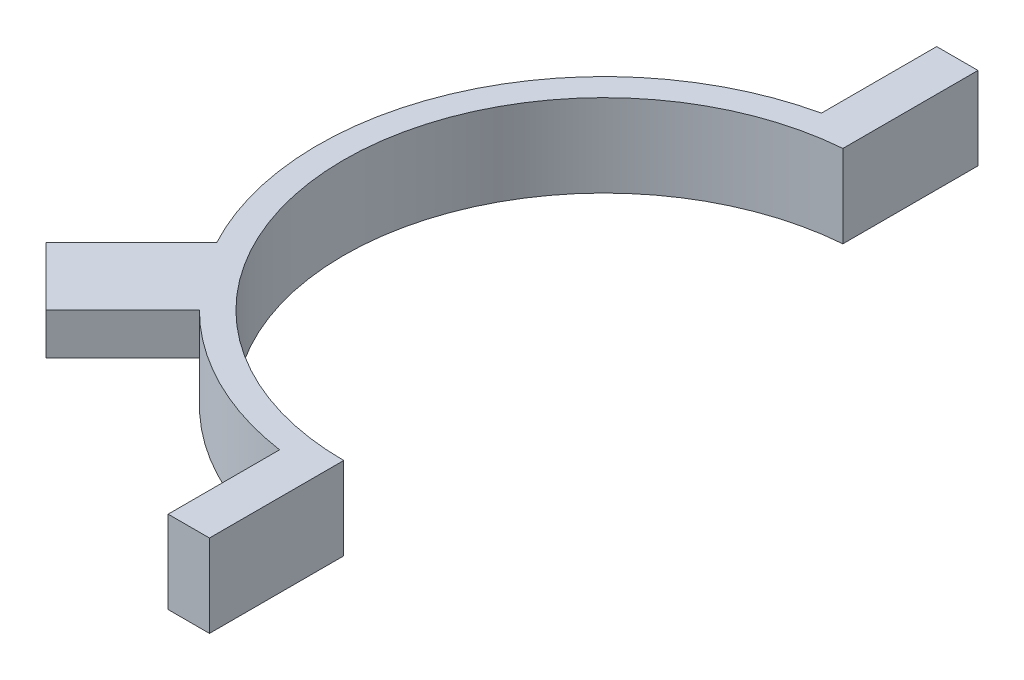
ISO-10303-21;
HEADER;
FILE_DESCRIPTION(('STEP AP214'),'2;1');
FILE_NAME('part.step','',(''),(''),'','','');
FILE_SCHEMA(('AUTOMOTIVE_DESIGN { 1 0 10303 214 1 1 1 1 }'));
ENDSEC;
DATA;
#1=APPLICATION_CONTEXT('core data for automotive mechanical design processes');
#2=APPLICATION_PROTOCOL_DEFINITION('international standard','automotive_design',2000,#1);
#3=PRODUCT_CONTEXT('',#1,'mechanical');
#4=PRODUCT('Part','Part','',(#3));
#5=PRODUCT_RELATED_PRODUCT_CATEGORY('part','',(#4));
#6=PRODUCT_DEFINITION_FORMATION('','',#4);
#7=PRODUCT_DEFINITION_CONTEXT('part definition',#1,'design');
#8=PRODUCT_DEFINITION('design','',#6,#7);
#9=PRODUCT_DEFINITION_SHAPE('','',#8);
#10=(LENGTH_UNIT() NAMED_UNIT(*) SI_UNIT(.MILLI.,.METRE.));
#11=(NAMED_UNIT(*) PLANE_ANGLE_UNIT() SI_UNIT($,.RADIAN.));
#12=(NAMED_UNIT(*) SI_UNIT($,.STERADIAN.) SOLID_ANGLE_UNIT());
#13=UNCERTAINTY_MEASURE_WITH_UNIT(LENGTH_MEASURE(1.E-05),#10,'distance_accuracy_value','');
#14=(GEOMETRIC_REPRESENTATION_CONTEXT(3) GLOBAL_UNCERTAINTY_ASSIGNED_CONTEXT((#13)) GLOBAL_UNIT_ASSIGNED_CONTEXT((#10,
#11,#12)) REPRESENTATION_CONTEXT('',''));
#15=CARTESIAN_POINT('',(0.,0.,0.));
#16=DIRECTION('',(0.,0.,1.));
#17=DIRECTION('',(1.,0.,0.));
#18=AXIS2_PLACEMENT_3D('',#15,#16,#17);
#19=CARTESIAN_POINT('',(0.,10.16,0.));
#20=DIRECTION('',(0.,-1.,0.));
#21=DIRECTION('',(0.,0.,-1.));
#22=AXIS2_PLACEMENT_3D('',#19,#20,#21);
#23=CYLINDRICAL_SURFACE('',#22,32.004);
#24=DIRECTION('',(0.,-1.,0.));
#25=VECTOR('',#24,1.);
#26=CARTESIAN_POINT('',(-2.54,10.16,-31.9030471271946));
#27=LINE('',#26,#25);
#28=CARTESIAN_POINT('',(-2.54,10.16,-31.9030471271946));
#29=VERTEX_POINT('',#28);
#30=CARTESIAN_POINT('',(-2.54,0.,-31.9030471271946));
#31=VERTEX_POINT('',#30);
#32=EDGE_CURVE('E40',#29,#31,#27,.T.);
#33=ORIENTED_EDGE('',*,*,#32,.F.);
#34=CARTESIAN_POINT('',(0.,10.16,0.));
#35=DIRECTION('',(0.,-1.,0.));
#36=DIRECTION('',(0.,0.,1.));
#37=AXIS2_PLACEMENT_3D('',#34,#35,#36);
#38=CIRCLE('',#37,32.004);
#39=CARTESIAN_POINT('',(0.,10.16,32.004));
#40=VERTEX_POINT('',#39);
#41=EDGE_CURVE('E197',#40,#29,#38,.T.);
#42=ORIENTED_EDGE('',*,*,#41,.F.);
#43=DIRECTION('',(0.,-1.,0.));
#44=VECTOR('',#43,1.);
#45=CARTESIAN_POINT('',(0.,10.16,32.004));
#46=LINE('',#45,#44);
#47=CARTESIAN_POINT('',(0.,0.,32.004));
#48=VERTEX_POINT('',#47);
#49=EDGE_CURVE('E206',#40,#48,#46,.T.);
#50=ORIENTED_EDGE('',*,*,#49,.T.);
#51=CARTESIAN_POINT('',(0.,0.,0.));
#52=DIRECTION('',(0.,-1.,0.));
#53=DIRECTION('',(0.,0.,1.));
#54=AXIS2_PLACEMENT_3D('',#51,#52,#53);
#55=CIRCLE('',#54,32.004);
#56=EDGE_CURVE('E196',#48,#31,#55,.T.);
#57=ORIENTED_EDGE('',*,*,#56,.T.);
#58=EDGE_LOOP('',(#33,#42,#50,#57));
#59=FACE_BOUND('',#58,.T.);
#60=ADVANCED_FACE('F33',(#59),#23,.F.);
#61=CARTESIAN_POINT('',(-2.54,10.16,-31.9030471271946));
#62=DIRECTION('',(-1.,0.,0.));
#63=DIRECTION('',(0.,0.,1.));
#64=AXIS2_PLACEMENT_3D('',#61,#62,#63);
#65=PLANE('',#64);
#66=DIRECTION('',(0.,0.,-1.));
#67=VECTOR('',#66,1.);
#68=CARTESIAN_POINT('',(-2.54,0.,-31.9030471271946));
#69=LINE('',#68,#67);
#70=CARTESIAN_POINT('',(-2.53999999999994,0.,-48.514));
#71=VERTEX_POINT('',#70);
#72=EDGE_CURVE('E209',#31,#71,#69,.T.);
#73=ORIENTED_EDGE('',*,*,#72,.T.);
#74=DIRECTION('',(0.,1.,0.));
#75=VECTOR('',#74,1.);
#76=CARTESIAN_POINT('',(-2.53999999999994,10.16,-48.514));
#77=LINE('',#76,#75);
#78=CARTESIAN_POINT('',(-2.53999999999994,10.16,-48.514));
#79=VERTEX_POINT('',#78);
#80=EDGE_CURVE('E158',#71,#79,#77,.T.);
#81=ORIENTED_EDGE('',*,*,#80,.T.);
#82=DIRECTION('',(0.,0.,-1.));
#83=VECTOR('',#82,1.);
#84=CARTESIAN_POINT('',(-2.54,10.16,-31.9030471271946));
#85=LINE('',#84,#83);
#86=EDGE_CURVE('E199',#29,#79,#85,.T.);
#87=ORIENTED_EDGE('',*,*,#86,.F.);
#88=ORIENTED_EDGE('',*,*,#32,.T.);
#89=EDGE_LOOP('',(#73,#81,#87,#88));
#90=FACE_BOUND('',#89,.T.);
#91=ADVANCED_FACE('F219',(#90),#65,.F.);
#92=CARTESIAN_POINT('',(0.,10.16,0.));
#93=DIRECTION('',(0.,-1.,0.));
#94=DIRECTION('',(0.,0.,-1.));
#95=AXIS2_PLACEMENT_3D('',#92,#93,#94);
#96=CYLINDRICAL_SURFACE('',#95,35.179);
#97=CARTESIAN_POINT('',(0.,5.08,0.));
#98=DIRECTION('',(0.,-1.,0.));
#99=DIRECTION('',(0.,0.,-1.));
#100=AXIS2_PLACEMENT_3D('',#97,#98,#99);
#101=CIRCLE('',#100,35.179);
#102=CARTESIAN_POINT('',(-24.8753094553616,5.08,24.8753094553615));
#103=VERTEX_POINT('',#102);
#104=CARTESIAN_POINT('',(-30.9994987329599,5.08,16.6310889392492));
#105=VERTEX_POINT('',#104);
#106=EDGE_CURVE('E11',#103,#105,#101,.T.);
#107=ORIENTED_EDGE('',*,*,#106,.T.);
#108=DIRECTION('',(0.,-1.,0.));
#109=VECTOR('',#108,1.);
#110=CARTESIAN_POINT('',(-30.9994987329599,10.16,16.6310889392492));
#111=LINE('',#110,#109);
#112=CARTESIAN_POINT('',(-30.9994987329599,10.16,16.6310889392492));
#113=VERTEX_POINT('',#112);
#114=EDGE_CURVE('E153',#105,#113,#111,.F.);
#115=ORIENTED_EDGE('',*,*,#114,.T.);
#116=CARTESIAN_POINT('',(0.,10.16,0.));
#117=DIRECTION('',(0.,1.,0.));
#118=DIRECTION('',(0.,0.,1.));
#119=AXIS2_PLACEMENT_3D('',#116,#117,#118);
#120=CIRCLE('',#119,35.179);
#121=CARTESIAN_POINT('',(-7.61999999999999,10.16,-34.3438151782821));
#122=VERTEX_POINT('',#121);
#123=EDGE_CURVE('E55',#122,#113,#120,.T.);
#124=ORIENTED_EDGE('',*,*,#123,.F.);
#125=DIRECTION('',(0.,-1.,0.));
#126=VECTOR('',#125,1.);
#127=CARTESIAN_POINT('',(-7.61999999999999,10.16,-34.3438151782821));
#128=LINE('',#127,#126);
#129=CARTESIAN_POINT('',(-7.61999999999999,0.,-34.3438151782821));
#130=VERTEX_POINT('',#129);
#131=EDGE_CURVE('E171',#122,#130,#128,.T.);
#132=ORIENTED_EDGE('',*,*,#131,.T.);
#133=CARTESIAN_POINT('',(0.,0.,0.));
#134=DIRECTION('',(0.,1.,0.));
#135=DIRECTION('',(0.,0.,1.));
#136=AXIS2_PLACEMENT_3D('',#133,#134,#135);
#137=CIRCLE('',#136,35.179);
#138=CARTESIAN_POINT('',(-5.08,0.,34.8102806797073));
#139=VERTEX_POINT('',#138);
#140=EDGE_CURVE('E211',#130,#139,#137,.T.);
#141=ORIENTED_EDGE('',*,*,#140,.T.);
#142=DIRECTION('',(0.,-1.,0.));
#143=VECTOR('',#142,1.);
#144=CARTESIAN_POINT('',(-5.08,10.16,34.8102806797073));
#145=LINE('',#144,#143);
#146=CARTESIAN_POINT('',(-5.08,10.16,34.8102806797073));
#147=VERTEX_POINT('',#146);
#148=EDGE_CURVE('E191',#139,#147,#145,.F.);
#149=ORIENTED_EDGE('',*,*,#148,.T.);
#150=CARTESIAN_POINT('',(-24.8753094553616,10.16,24.8753094553615));
#151=VERTEX_POINT('',#150);
#152=EDGE_CURVE('E202',#151,#147,#120,.T.);
#153=ORIENTED_EDGE('',*,*,#152,.F.);
#154=DIRECTION('',(0.,-1.,0.));
#155=VECTOR('',#154,1.);
#156=CARTESIAN_POINT('',(-24.8753094553616,10.16,24.8753094553615));
#157=LINE('',#156,#155);
#158=EDGE_CURVE('E150',#151,#103,#157,.T.);
#159=ORIENTED_EDGE('',*,*,#158,.T.);
#160=EDGE_LOOP('',(#107,#115,#124,#132,#141,#149,#153,#159));
#161=FACE_BOUND('',#160,.T.);
#162=ADVANCED_FACE('F248',(#161),#96,.T.);
#163=CARTESIAN_POINT('',(0.,10.16,32.004));
#164=DIRECTION('',(-1.,0.,0.));
#165=DIRECTION('',(0.,0.,1.));
#166=AXIS2_PLACEMENT_3D('',#163,#164,#165);
#167=PLANE('',#166);
#168=DIRECTION('',(0.,0.,-1.));
#169=VECTOR('',#168,1.);
#170=CARTESIAN_POINT('',(0.,0.,32.004));
#171=LINE('',#170,#169);
#172=CARTESIAN_POINT('',(0.,0.,48.514));
#173=VERTEX_POINT('',#172);
#174=EDGE_CURVE('E200',#173,#48,#171,.T.);
#175=ORIENTED_EDGE('',*,*,#174,.T.);
#176=ORIENTED_EDGE('',*,*,#49,.F.);
#177=DIRECTION('',(0.,0.,-1.));
#178=VECTOR('',#177,1.);
#179=CARTESIAN_POINT('',(0.,10.16,32.004));
#180=LINE('',#179,#178);
#181=CARTESIAN_POINT('',(0.,10.16,48.514));
#182=VERTEX_POINT('',#181);
#183=EDGE_CURVE('E204',#182,#40,#180,.T.);
#184=ORIENTED_EDGE('',*,*,#183,.F.);
#185=DIRECTION('',(0.,-1.,0.));
#186=VECTOR('',#185,1.);
#187=CARTESIAN_POINT('',(0.,10.16,48.514));
#188=LINE('',#187,#186);
#189=EDGE_CURVE('E184',#182,#173,#188,.T.);
#190=ORIENTED_EDGE('',*,*,#189,.T.);
#191=EDGE_LOOP('',(#175,#176,#184,#190));
#192=FACE_BOUND('',#191,.T.);
#193=ADVANCED_FACE('F240',(#192),#167,.F.);
#194=CARTESIAN_POINT('',(0.,10.16,0.));
#195=DIRECTION('',(0.,1.,0.));
#196=DIRECTION('',(0.,0.,1.));
#197=AXIS2_PLACEMENT_3D('',#194,#195,#196);
#198=PLANE('',#197);
#199=ORIENTED_EDGE('',*,*,#123,.T.);
#200=DIRECTION('',(-0.707106781186549,0.,0.707106781186546));
#201=VECTOR('',#200,1.);
#202=CARTESIAN_POINT('',(-29.8144503219496,10.16,15.4460405282389));
#203=LINE('',#202,#201);
#204=CARTESIAN_POINT('',(-41.4887832793395,10.16,27.1203734856288));
#205=VERTEX_POINT('',#204);
#206=EDGE_CURVE('E142',#113,#205,#203,.T.);
#207=ORIENTED_EDGE('',*,*,#206,.T.);
#208=DIRECTION('',(0.707106781186546,0.,0.707106781186549));
#209=VECTOR('',#208,1.);
#210=CARTESIAN_POINT('',(-41.4887832793395,10.16,27.1203734856288));
#211=LINE('',#210,#209);
#212=CARTESIAN_POINT('',(-34.3045783824842,10.16,34.3045783824841));
#213=VERTEX_POINT('',#212);
#214=EDGE_CURVE('E147',#205,#213,#211,.T.);
#215=ORIENTED_EDGE('',*,*,#214,.T.);
#216=DIRECTION('',(0.707106781186549,0.,-0.707106781186546));
#217=VECTOR('',#216,1.);
#218=CARTESIAN_POINT('',(-22.6302454250943,10.16,22.6302454250942));
#219=LINE('',#218,#217);
#220=EDGE_CURVE('E47',#213,#151,#219,.T.);
#221=ORIENTED_EDGE('',*,*,#220,.T.);
#222=ORIENTED_EDGE('',*,*,#152,.T.);
#223=DIRECTION('',(0.,0.,-1.));
#224=VECTOR('',#223,1.);
#225=CARTESIAN_POINT('',(-5.08000000000005,10.16,48.514));
#226=LINE('',#225,#224);
#227=CARTESIAN_POINT('',(-5.08000000000005,10.16,48.514));
#228=VERTEX_POINT('',#227);
#229=EDGE_CURVE('E188',#228,#147,#226,.T.);
#230=ORIENTED_EDGE('',*,*,#229,.F.);
#231=DIRECTION('',(1.,0.,0.));
#232=VECTOR('',#231,1.);
#233=CARTESIAN_POINT('',(-5.08000000000005,10.16,48.514));
#234=LINE('',#233,#232);
#235=EDGE_CURVE('E181',#228,#182,#234,.T.);
#236=ORIENTED_EDGE('',*,*,#235,.T.);
#237=ORIENTED_EDGE('',*,*,#183,.T.);
#238=ORIENTED_EDGE('',*,*,#41,.T.);
#239=ORIENTED_EDGE('',*,*,#86,.T.);
#240=DIRECTION('',(-1.,0.,0.));
#241=VECTOR('',#240,1.);
#242=CARTESIAN_POINT('',(-2.53999999999994,10.16,-48.514));
#243=LINE('',#242,#241);
#244=CARTESIAN_POINT('',(-7.61999999999994,10.16,-48.514));
#245=VERTEX_POINT('',#244);
#246=EDGE_CURVE('E161',#79,#245,#243,.T.);
#247=ORIENTED_EDGE('',*,*,#246,.T.);
#248=DIRECTION('',(0.,0.,1.));
#249=VECTOR('',#248,1.);
#250=CARTESIAN_POINT('',(-7.61999999999994,10.16,-48.514));
#251=LINE('',#250,#249);
#252=EDGE_CURVE('E167',#245,#122,#251,.T.);
#253=ORIENTED_EDGE('',*,*,#252,.T.);
#254=EDGE_LOOP('',(#199,#207,#215,#221,#222,#230,#236,#237,#238,#239,#247,#253));
#255=FACE_BOUND('',#254,.T.);
#256=ADVANCED_FACE('F236',(#255),#198,.T.);
#257=CARTESIAN_POINT('',(0.,0.,0.));
#258=DIRECTION('',(0.,1.,0.));
#259=DIRECTION('',(0.,0.,1.));
#260=AXIS2_PLACEMENT_3D('',#257,#258,#259);
#261=PLANE('',#260);
#262=ORIENTED_EDGE('',*,*,#140,.F.);
#263=DIRECTION('',(0.,0.,1.));
#264=VECTOR('',#263,1.);
#265=CARTESIAN_POINT('',(-7.61999999999994,0.,-48.514));
#266=LINE('',#265,#264);
#267=CARTESIAN_POINT('',(-7.61999999999994,0.,-48.514));
#268=VERTEX_POINT('',#267);
#269=EDGE_CURVE('E168',#268,#130,#266,.T.);
#270=ORIENTED_EDGE('',*,*,#269,.F.);
#271=DIRECTION('',(1.,0.,0.));
#272=VECTOR('',#271,1.);
#273=CARTESIAN_POINT('',(-2.53999999999994,0.,-48.514));
#274=LINE('',#273,#272);
#275=EDGE_CURVE('E155',#268,#71,#274,.T.);
#276=ORIENTED_EDGE('',*,*,#275,.T.);
#277=ORIENTED_EDGE('',*,*,#72,.F.);
#278=ORIENTED_EDGE('',*,*,#56,.F.);
#279=ORIENTED_EDGE('',*,*,#174,.F.);
#280=DIRECTION('',(-1.,0.,0.));
#281=VECTOR('',#280,1.);
#282=CARTESIAN_POINT('',(-5.08000000000005,0.,48.514));
#283=LINE('',#282,#281);
#284=CARTESIAN_POINT('',(-5.08000000000005,0.,48.514));
#285=VERTEX_POINT('',#284);
#286=EDGE_CURVE('E175',#173,#285,#283,.T.);
#287=ORIENTED_EDGE('',*,*,#286,.T.);
#288=DIRECTION('',(0.,0.,-1.));
#289=VECTOR('',#288,1.);
#290=CARTESIAN_POINT('',(-5.08000000000005,0.,48.514));
#291=LINE('',#290,#289);
#292=EDGE_CURVE('E187',#285,#139,#291,.T.);
#293=ORIENTED_EDGE('',*,*,#292,.T.);
#294=EDGE_LOOP('',(#262,#270,#276,#277,#278,#279,#287,#293));
#295=FACE_BOUND('',#294,.T.);
#296=ADVANCED_FACE('F227',(#295),#261,.F.);
#297=CARTESIAN_POINT('',(-5.08000000000005,10.16,48.514));
#298=DIRECTION('',(-1.,0.,0.));
#299=DIRECTION('',(0.,0.,1.));
#300=AXIS2_PLACEMENT_3D('',#297,#298,#299);
#301=PLANE('',#300);
#302=ORIENTED_EDGE('',*,*,#148,.F.);
#303=ORIENTED_EDGE('',*,*,#292,.F.);
#304=DIRECTION('',(0.,1.,0.));
#305=VECTOR('',#304,1.);
#306=CARTESIAN_POINT('',(-5.08000000000005,10.16,48.514));
#307=LINE('',#306,#305);
#308=EDGE_CURVE('E178',#285,#228,#307,.T.);
#309=ORIENTED_EDGE('',*,*,#308,.T.);
#310=ORIENTED_EDGE('',*,*,#229,.T.);
#311=EDGE_LOOP('',(#302,#303,#309,#310));
#312=FACE_BOUND('',#311,.T.);
#313=ADVANCED_FACE('F246',(#312),#301,.T.);
#314=CARTESIAN_POINT('',(-1.43052528228139E-13,0.,48.514));
#315=DIRECTION('',(0.,0.,-1.));
#316=DIRECTION('',(-1.,0.,0.));
#317=AXIS2_PLACEMENT_3D('',#314,#315,#316);
#318=PLANE('',#317);
#319=ORIENTED_EDGE('',*,*,#286,.F.);
#320=ORIENTED_EDGE('',*,*,#189,.F.);
#321=ORIENTED_EDGE('',*,*,#235,.F.);
#322=ORIENTED_EDGE('',*,*,#308,.F.);
#323=EDGE_LOOP('',(#319,#320,#321,#322));
#324=FACE_BOUND('',#323,.T.);
#325=ADVANCED_FACE('F242',(#324),#318,.F.);
#326=CARTESIAN_POINT('',(-7.61999999999994,10.16,-48.514));
#327=DIRECTION('',(-1.,0.,0.));
#328=DIRECTION('',(0.,0.,1.));
#329=AXIS2_PLACEMENT_3D('',#326,#327,#328);
#330=PLANE('',#329);
#331=ORIENTED_EDGE('',*,*,#131,.F.);
#332=ORIENTED_EDGE('',*,*,#252,.F.);
#333=DIRECTION('',(0.,-1.,0.));
#334=VECTOR('',#333,1.);
#335=CARTESIAN_POINT('',(-7.61999999999994,10.16,-48.514));
#336=LINE('',#335,#334);
#337=EDGE_CURVE('E164',#245,#268,#336,.T.);
#338=ORIENTED_EDGE('',*,*,#337,.T.);
#339=ORIENTED_EDGE('',*,*,#269,.T.);
#340=EDGE_LOOP('',(#331,#332,#338,#339));
#341=FACE_BOUND('',#340,.T.);
#342=ADVANCED_FACE('F235',(#341),#330,.T.);
#343=CARTESIAN_POINT('',(1.88789451688147E-13,0.,-48.514));
#344=DIRECTION('',(0.,0.,1.));
#345=DIRECTION('',(1.,0.,0.));
#346=AXIS2_PLACEMENT_3D('',#343,#344,#345);
#347=PLANE('',#346);
#348=ORIENTED_EDGE('',*,*,#275,.F.);
#349=ORIENTED_EDGE('',*,*,#337,.F.);
#350=ORIENTED_EDGE('',*,*,#246,.F.);
#351=ORIENTED_EDGE('',*,*,#80,.F.);
#352=EDGE_LOOP('',(#348,#349,#350,#351));
#353=FACE_BOUND('',#352,.T.);
#354=ADVANCED_FACE('F232',(#353),#347,.F.);
#355=CARTESIAN_POINT('',(-29.8144503219496,5.08,15.4460405282389));
#356=DIRECTION('',(-0.707106781186546,0.,-0.707106781186549));
#357=DIRECTION('',(-0.707106781186549,0.,0.707106781186546));
#358=AXIS2_PLACEMENT_3D('',#355,#356,#357);
#359=PLANE('',#358);
#360=ORIENTED_EDGE('',*,*,#114,.F.);
#361=DIRECTION('',(-0.707106781186549,0.,0.707106781186546));
#362=VECTOR('',#361,1.);
#363=CARTESIAN_POINT('',(-29.8144503219496,5.08,15.4460405282389));
#364=LINE('',#363,#362);
#365=CARTESIAN_POINT('',(-41.4887832793395,5.08,27.1203734856288));
#366=VERTEX_POINT('',#365);
#367=EDGE_CURVE('E131',#105,#366,#364,.T.);
#368=ORIENTED_EDGE('',*,*,#367,.T.);
#369=DIRECTION('',(0.,1.,0.));
#370=VECTOR('',#369,1.);
#371=CARTESIAN_POINT('',(-41.4887832793395,5.08,27.1203734856288));
#372=LINE('',#371,#370);
#373=EDGE_CURVE('E130',#366,#205,#372,.T.);
#374=ORIENTED_EDGE('',*,*,#373,.T.);
#375=ORIENTED_EDGE('',*,*,#206,.F.);
#376=EDGE_LOOP('',(#360,#368,#374,#375));
#377=FACE_BOUND('',#376,.T.);
#378=ADVANCED_FACE('F250',(#377),#359,.T.);
#379=CARTESIAN_POINT('',(-22.6302454250943,5.08,22.6302454250942));
#380=DIRECTION('',(0.707106781186546,0.,0.707106781186549));
#381=DIRECTION('',(0.707106781186549,0.,-0.707106781186546));
#382=AXIS2_PLACEMENT_3D('',#379,#380,#381);
#383=PLANE('',#382);
#384=ORIENTED_EDGE('',*,*,#158,.F.);
#385=ORIENTED_EDGE('',*,*,#220,.F.);
#386=DIRECTION('',(0.,1.,0.));
#387=VECTOR('',#386,1.);
#388=CARTESIAN_POINT('',(-34.3045783824842,5.08,34.3045783824841));
#389=LINE('',#388,#387);
#390=CARTESIAN_POINT('',(-34.3045783824842,5.08,34.3045783824841));
#391=VERTEX_POINT('',#390);
#392=EDGE_CURVE('E122',#391,#213,#389,.T.);
#393=ORIENTED_EDGE('',*,*,#392,.F.);
#394=DIRECTION('',(0.707106781186549,0.,-0.707106781186546));
#395=VECTOR('',#394,1.);
#396=CARTESIAN_POINT('',(-22.6302454250943,5.08,22.6302454250942));
#397=LINE('',#396,#395);
#398=EDGE_CURVE('E125',#391,#103,#397,.T.);
#399=ORIENTED_EDGE('',*,*,#398,.T.);
#400=EDGE_LOOP('',(#384,#385,#393,#399));
#401=FACE_BOUND('',#400,.T.);
#402=ADVANCED_FACE('F124',(#401),#383,.T.);
#403=CARTESIAN_POINT('',(-41.4887832793395,5.08,27.1203734856288));
#404=DIRECTION('',(-0.70710678118655,0.,0.707106781186546));
#405=DIRECTION('',(0.707106781186546,0.,0.70710678118655));
#406=AXIS2_PLACEMENT_3D('',#403,#404,#405);
#407=PLANE('',#406);
#408=ORIENTED_EDGE('',*,*,#214,.F.);
#409=ORIENTED_EDGE('',*,*,#373,.F.);
#410=DIRECTION('',(0.707106781186546,0.,0.707106781186549));
#411=VECTOR('',#410,1.);
#412=CARTESIAN_POINT('',(-41.4887832793395,5.08,27.1203734856288));
#413=LINE('',#412,#411);
#414=EDGE_CURVE('E137',#366,#391,#413,.T.);
#415=ORIENTED_EDGE('',*,*,#414,.T.);
#416=ORIENTED_EDGE('',*,*,#392,.T.);
#417=EDGE_LOOP('',(#408,#409,#415,#416));
#418=FACE_BOUND('',#417,.T.);
#419=ADVANCED_FACE('F140',(#418),#407,.T.);
#420=CARTESIAN_POINT('',(0.,5.08,0.));
#421=DIRECTION('',(0.,-1.,0.));
#422=DIRECTION('',(0.,0.,-1.));
#423=AXIS2_PLACEMENT_3D('',#420,#421,#422);
#424=PLANE('',#423);
#425=ORIENTED_EDGE('',*,*,#106,.F.);
#426=ORIENTED_EDGE('',*,*,#398,.F.);
#427=ORIENTED_EDGE('',*,*,#414,.F.);
#428=ORIENTED_EDGE('',*,*,#367,.F.);
#429=EDGE_LOOP('',(#425,#426,#427,#428));
#430=FACE_BOUND('',#429,.T.);
#431=ADVANCED_FACE('F135',(#430),#424,.T.);
#432=CLOSED_SHELL('',(#60,#91,#162,#193,#256,#296,#313,#325,#342,#354,#378,#402,#419,#431));
#433=MANIFOLD_SOLID_BREP('B2',#432);
#434=ADVANCED_BREP_SHAPE_REPRESENTATION('',(#18,#433),#14);
#435=SHAPE_DEFINITION_REPRESENTATION(#9,#434);
ENDSEC;
END-ISO-10303-21;
